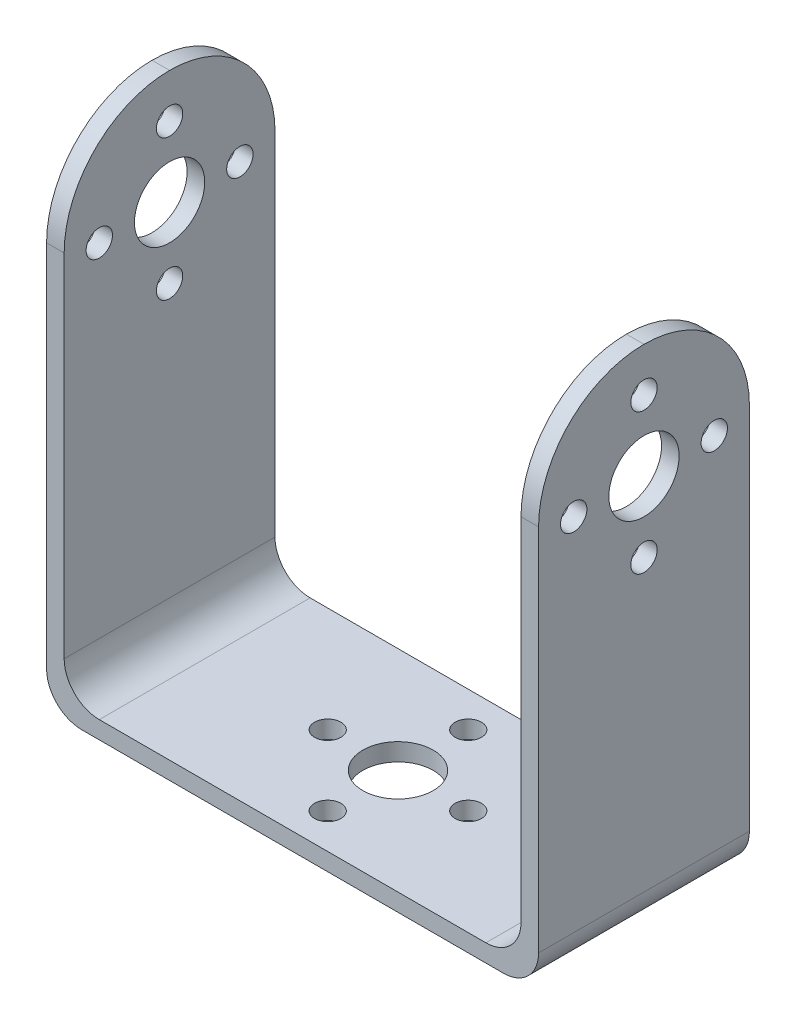
ISO-10303-21;
HEADER;
FILE_DESCRIPTION(('STEP AP214'),'2;1');
FILE_NAME('part.step','',(''),(''),'','','');
FILE_SCHEMA(('AUTOMOTIVE_DESIGN { 1 0 10303 214 1 1 1 1 }'));
ENDSEC;
DATA;
#1=APPLICATION_CONTEXT('core data for automotive mechanical design processes');
#2=APPLICATION_PROTOCOL_DEFINITION('international standard','automotive_design',2000,#1);
#3=PRODUCT_CONTEXT('',#1,'mechanical');
#4=PRODUCT('Part','Part','',(#3));
#5=PRODUCT_RELATED_PRODUCT_CATEGORY('part','',(#4));
#6=PRODUCT_DEFINITION_FORMATION('','',#4);
#7=PRODUCT_DEFINITION_CONTEXT('part definition',#1,'design');
#8=PRODUCT_DEFINITION('design','',#6,#7);
#9=PRODUCT_DEFINITION_SHAPE('','',#8);
#10=(LENGTH_UNIT() NAMED_UNIT(*) SI_UNIT(.MILLI.,.METRE.));
#11=(NAMED_UNIT(*) PLANE_ANGLE_UNIT() SI_UNIT($,.RADIAN.));
#12=(NAMED_UNIT(*) SI_UNIT($,.STERADIAN.) SOLID_ANGLE_UNIT());
#13=UNCERTAINTY_MEASURE_WITH_UNIT(LENGTH_MEASURE(1.E-05),#10,'distance_accuracy_value','');
#14=(GEOMETRIC_REPRESENTATION_CONTEXT(3) GLOBAL_UNCERTAINTY_ASSIGNED_CONTEXT((#13)) GLOBAL_UNIT_ASSIGNED_CONTEXT((#10,
#11,#12)) REPRESENTATION_CONTEXT('',''));
#15=CARTESIAN_POINT('',(0.,0.,0.));
#16=DIRECTION('',(0.,0.,1.));
#17=DIRECTION('',(1.,0.,0.));
#18=AXIS2_PLACEMENT_3D('',#15,#16,#17);
#19=CARTESIAN_POINT('',(-80.3013006654568,50.4267145135566,24.));
#20=DIRECTION('',(1.,0.,0.));
#21=DIRECTION('',(0.,0.,-1.));
#22=AXIS2_PLACEMENT_3D('',#19,#20,#21);
#23=PLANE('',#22);
#24=CARTESIAN_POINT('',(-80.3013006654568,37.4267145135566,12.));
#25=DIRECTION('',(-1.,0.,0.));
#26=DIRECTION('',(0.,0.,1.));
#27=AXIS2_PLACEMENT_3D('',#24,#25,#26);
#28=CIRCLE('',#27,3.99999999999999);
#29=CARTESIAN_POINT('',(-80.3013006654568,37.4267145135566,16.));
#30=VERTEX_POINT('',#29);
#31=EDGE_CURVE('E497',#30,#30,#28,.T.);
#32=ORIENTED_EDGE('',*,*,#31,.F.);
#33=EDGE_LOOP('',(#32));
#34=FACE_BOUND('',#33,.T.);
#35=CARTESIAN_POINT('',(-80.3013006654568,29.4267145135566,12.));
#36=DIRECTION('',(-1.,0.,0.));
#37=DIRECTION('',(0.,0.,1.));
#38=AXIS2_PLACEMENT_3D('',#35,#36,#37);
#39=CIRCLE('',#38,1.5);
#40=CARTESIAN_POINT('',(-80.3013006654568,29.4267145135566,13.5));
#41=VERTEX_POINT('',#40);
#42=EDGE_CURVE('E502',#41,#41,#39,.T.);
#43=ORIENTED_EDGE('',*,*,#42,.F.);
#44=EDGE_LOOP('',(#43));
#45=FACE_BOUND('',#44,.T.);
#46=CARTESIAN_POINT('',(-80.3013006654568,37.4267145135566,20.));
#47=DIRECTION('',(-1.,0.,0.));
#48=DIRECTION('',(0.,0.,1.));
#49=AXIS2_PLACEMENT_3D('',#46,#47,#48);
#50=CIRCLE('',#49,1.5);
#51=CARTESIAN_POINT('',(-80.3013006654568,37.4267145135566,21.5));
#52=VERTEX_POINT('',#51);
#53=EDGE_CURVE('E508',#52,#52,#50,.T.);
#54=ORIENTED_EDGE('',*,*,#53,.F.);
#55=EDGE_LOOP('',(#54));
#56=FACE_BOUND('',#55,.T.);
#57=CARTESIAN_POINT('',(-80.3013006654568,45.4267145135566,12.0000000000001));
#58=DIRECTION('',(-1.,0.,0.));
#59=DIRECTION('',(0.,0.,1.));
#60=AXIS2_PLACEMENT_3D('',#57,#58,#59);
#61=CIRCLE('',#60,1.50000000000001);
#62=CARTESIAN_POINT('',(-80.3013006654568,45.4267145135566,13.5000000000001));
#63=VERTEX_POINT('',#62);
#64=EDGE_CURVE('E514',#63,#63,#61,.T.);
#65=ORIENTED_EDGE('',*,*,#64,.F.);
#66=EDGE_LOOP('',(#65));
#67=FACE_BOUND('',#66,.T.);
#68=CARTESIAN_POINT('',(-80.3013006654568,37.4267145135567,4.));
#69=DIRECTION('',(-1.,0.,0.));
#70=DIRECTION('',(0.,0.,1.));
#71=AXIS2_PLACEMENT_3D('',#68,#69,#70);
#72=CIRCLE('',#71,1.5);
#73=CARTESIAN_POINT('',(-80.3013006654568,37.4267145135567,5.5));
#74=VERTEX_POINT('',#73);
#75=EDGE_CURVE('E301',#74,#74,#72,.T.);
#76=ORIENTED_EDGE('',*,*,#75,.F.);
#77=EDGE_LOOP('',(#76));
#78=FACE_BOUND('',#77,.T.);
#79=DIRECTION('',(0.,-1.,0.));
#80=VECTOR('',#79,1.);
#81=CARTESIAN_POINT('',(-80.3013006654568,50.4267145135566,0.));
#82=LINE('',#81,#80);
#83=CARTESIAN_POINT('',(-80.3013006654568,38.4267145135566,0.));
#84=VERTEX_POINT('',#83);
#85=CARTESIAN_POINT('',(-80.3013006654568,-3.57328548644335,0.));
#86=VERTEX_POINT('',#85);
#87=EDGE_CURVE('E150',#84,#86,#82,.T.);
#88=ORIENTED_EDGE('',*,*,#87,.T.);
#89=DIRECTION('',(0.,0.,-1.));
#90=VECTOR('',#89,1.);
#91=CARTESIAN_POINT('',(-80.3013006654568,-3.57328548644337,24.));
#92=LINE('',#91,#90);
#93=CARTESIAN_POINT('',(-80.3013006654568,-3.57328548644335,24.));
#94=VERTEX_POINT('',#93);
#95=EDGE_CURVE('E61',#86,#94,#92,.F.);
#96=ORIENTED_EDGE('',*,*,#95,.T.);
#97=DIRECTION('',(0.,-1.,0.));
#98=VECTOR('',#97,1.);
#99=CARTESIAN_POINT('',(-80.3013006654568,50.4267145135566,24.));
#100=LINE('',#99,#98);
#101=CARTESIAN_POINT('',(-80.3013006654568,38.4267145135566,24.));
#102=VERTEX_POINT('',#101);
#103=EDGE_CURVE('E271',#102,#94,#100,.T.);
#104=ORIENTED_EDGE('',*,*,#103,.F.);
#105=CARTESIAN_POINT('',(-80.3013006654568,38.4267145135566,12.));
#106=DIRECTION('',(1.,0.,0.));
#107=DIRECTION('',(0.,0.,-1.));
#108=AXIS2_PLACEMENT_3D('',#105,#106,#107);
#109=CIRCLE('',#108,12.);
#110=CARTESIAN_POINT('',(-80.3013006654568,50.4267145135566,12.));
#111=VERTEX_POINT('',#110);
#112=EDGE_CURVE('E152',#102,#111,#109,.F.);
#113=ORIENTED_EDGE('',*,*,#112,.T.);
#114=CARTESIAN_POINT('',(-80.3013006654568,38.4267145135566,12.));
#115=DIRECTION('',(1.,0.,0.));
#116=DIRECTION('',(0.,0.,-1.));
#117=AXIS2_PLACEMENT_3D('',#114,#115,#116);
#118=CIRCLE('',#117,12.);
#119=EDGE_CURVE('E148',#111,#84,#118,.F.);
#120=ORIENTED_EDGE('',*,*,#119,.T.);
#121=EDGE_LOOP('',(#88,#96,#104,#113,#120));
#122=FACE_BOUND('',#121,.T.);
#123=ADVANCED_FACE('F46',(#34,#45,#56,#67,#78,#122),#23,.F.);
#124=CARTESIAN_POINT('',(-80.3013006654568,-7.57328548644337,24.));
#125=DIRECTION('',(0.,1.,0.));
#126=DIRECTION('',(0.,0.,1.));
#127=AXIS2_PLACEMENT_3D('',#124,#125,#126);
#128=PLANE('',#127);
#129=CARTESIAN_POINT('',(-52.3013006654567,-7.57328548644337,20.));
#130=DIRECTION('',(0.,-1.,0.));
#131=DIRECTION('',(0.,0.,-1.));
#132=AXIS2_PLACEMENT_3D('',#129,#130,#131);
#133=CIRCLE('',#132,1.5);
#134=CARTESIAN_POINT('',(-52.3013006654567,-7.57328548644337,18.5));
#135=VERTEX_POINT('',#134);
#136=EDGE_CURVE('E478',#135,#135,#133,.T.);
#137=ORIENTED_EDGE('',*,*,#136,.F.);
#138=EDGE_LOOP('',(#137));
#139=FACE_BOUND('',#138,.T.);
#140=CARTESIAN_POINT('',(-52.3013006654568,-7.57328548644337,12.));
#141=DIRECTION('',(0.,-1.,0.));
#142=DIRECTION('',(0.,0.,-1.));
#143=AXIS2_PLACEMENT_3D('',#140,#141,#142);
#144=CIRCLE('',#143,4.);
#145=CARTESIAN_POINT('',(-52.3013006654568,-7.57328548644337,8.));
#146=VERTEX_POINT('',#145);
#147=EDGE_CURVE('E471',#146,#146,#144,.T.);
#148=ORIENTED_EDGE('',*,*,#147,.F.);
#149=EDGE_LOOP('',(#148));
#150=FACE_BOUND('',#149,.T.);
#151=CARTESIAN_POINT('',(-60.3013006654568,-7.57328548644337,12.));
#152=DIRECTION('',(0.,-1.,0.));
#153=DIRECTION('',(0.,0.,-1.));
#154=AXIS2_PLACEMENT_3D('',#151,#152,#153);
#155=CIRCLE('',#154,1.5);
#156=CARTESIAN_POINT('',(-60.3013006654568,-7.57328548644337,10.5));
#157=VERTEX_POINT('',#156);
#158=EDGE_CURVE('E476',#157,#157,#155,.T.);
#159=ORIENTED_EDGE('',*,*,#158,.F.);
#160=EDGE_LOOP('',(#159));
#161=FACE_BOUND('',#160,.T.);
#162=CARTESIAN_POINT('',(-52.3013006654568,-7.57328548644337,4.));
#163=DIRECTION('',(0.,-1.,0.));
#164=DIRECTION('',(0.,0.,-1.));
#165=AXIS2_PLACEMENT_3D('',#162,#163,#164);
#166=CIRCLE('',#165,1.5);
#167=CARTESIAN_POINT('',(-52.3013006654568,-7.57328548644337,2.5));
#168=VERTEX_POINT('',#167);
#169=EDGE_CURVE('E487',#168,#168,#166,.T.);
#170=ORIENTED_EDGE('',*,*,#169,.F.);
#171=EDGE_LOOP('',(#170));
#172=FACE_BOUND('',#171,.T.);
#173=CARTESIAN_POINT('',(-44.3013006654568,-7.57328548644337,11.9999999999999));
#174=DIRECTION('',(0.,-1.,0.));
#175=DIRECTION('',(0.,0.,-1.));
#176=AXIS2_PLACEMENT_3D('',#173,#174,#175);
#177=CIRCLE('',#176,1.5);
#178=CARTESIAN_POINT('',(-44.3013006654568,-7.57328548644337,10.4999999999999));
#179=VERTEX_POINT('',#178);
#180=EDGE_CURVE('E490',#179,#179,#177,.T.);
#181=ORIENTED_EDGE('',*,*,#180,.F.);
#182=EDGE_LOOP('',(#181));
#183=FACE_BOUND('',#182,.T.);
#184=DIRECTION('',(1.,0.,0.));
#185=VECTOR('',#184,1.);
#186=CARTESIAN_POINT('',(-80.3013006654568,-7.57328548644337,0.));
#187=LINE('',#186,#185);
#188=CARTESIAN_POINT('',(-76.3013006654568,-7.57328548644337,0.));
#189=VERTEX_POINT('',#188);
#190=CARTESIAN_POINT('',(-28.3013006654568,-7.57328548644337,0.));
#191=VERTEX_POINT('',#190);
#192=EDGE_CURVE('E167',#189,#191,#187,.T.);
#193=ORIENTED_EDGE('',*,*,#192,.T.);
#194=DIRECTION('',(0.,0.,-1.));
#195=VECTOR('',#194,1.);
#196=CARTESIAN_POINT('',(-28.3013006654568,-7.57328548644337,24.));
#197=LINE('',#196,#195);
#198=CARTESIAN_POINT('',(-28.3013006654568,-7.57328548644337,24.));
#199=VERTEX_POINT('',#198);
#200=EDGE_CURVE('E69',#191,#199,#197,.F.);
#201=ORIENTED_EDGE('',*,*,#200,.T.);
#202=DIRECTION('',(1.,0.,0.));
#203=VECTOR('',#202,1.);
#204=CARTESIAN_POINT('',(-80.3013006654568,-7.57328548644337,24.));
#205=LINE('',#204,#203);
#206=CARTESIAN_POINT('',(-76.3013006654568,-7.57328548644337,24.));
#207=VERTEX_POINT('',#206);
#208=EDGE_CURVE('E312',#207,#199,#205,.T.);
#209=ORIENTED_EDGE('',*,*,#208,.F.);
#210=DIRECTION('',(0.,0.,-1.));
#211=VECTOR('',#210,1.);
#212=CARTESIAN_POINT('',(-76.3013006654568,-7.57328548644337,24.));
#213=LINE('',#212,#211);
#214=EDGE_CURVE('E218',#207,#189,#213,.T.);
#215=ORIENTED_EDGE('',*,*,#214,.T.);
#216=EDGE_LOOP('',(#193,#201,#209,#215));
#217=FACE_BOUND('',#216,.T.);
#218=ADVANCED_FACE('F337',(#139,#150,#161,#172,#183,#217),#128,.F.);
#219=CARTESIAN_POINT('',(-24.3013006654568,-7.57328548644337,24.));
#220=DIRECTION('',(-1.,0.,0.));
#221=DIRECTION('',(0.,0.,1.));
#222=AXIS2_PLACEMENT_3D('',#219,#220,#221);
#223=PLANE('',#222);
#224=CARTESIAN_POINT('',(-24.3013006654568,45.4267145135566,12.));
#225=DIRECTION('',(1.,0.,0.));
#226=DIRECTION('',(0.,0.,-1.));
#227=AXIS2_PLACEMENT_3D('',#224,#225,#226);
#228=CIRCLE('',#227,1.5);
#229=CARTESIAN_POINT('',(-24.3013006654568,45.4267145135566,10.5));
#230=VERTEX_POINT('',#229);
#231=EDGE_CURVE('E290',#230,#230,#228,.T.);
#232=ORIENTED_EDGE('',*,*,#231,.F.);
#233=EDGE_LOOP('',(#232));
#234=FACE_BOUND('',#233,.T.);
#235=CARTESIAN_POINT('',(-24.3013006654568,37.4267145135566,20.));
#236=DIRECTION('',(1.,0.,0.));
#237=DIRECTION('',(0.,0.,-1.));
#238=AXIS2_PLACEMENT_3D('',#235,#236,#237);
#239=CIRCLE('',#238,1.5);
#240=CARTESIAN_POINT('',(-24.3013006654568,37.4267145135566,18.5));
#241=VERTEX_POINT('',#240);
#242=EDGE_CURVE('E286',#241,#241,#239,.T.);
#243=ORIENTED_EDGE('',*,*,#242,.F.);
#244=EDGE_LOOP('',(#243));
#245=FACE_BOUND('',#244,.T.);
#246=CARTESIAN_POINT('',(-24.3013006654568,29.4267145135566,12.));
#247=DIRECTION('',(1.,0.,0.));
#248=DIRECTION('',(0.,0.,-1.));
#249=AXIS2_PLACEMENT_3D('',#246,#247,#248);
#250=CIRCLE('',#249,1.5);
#251=CARTESIAN_POINT('',(-24.3013006654568,29.4267145135566,10.5));
#252=VERTEX_POINT('',#251);
#253=EDGE_CURVE('E282',#252,#252,#250,.T.);
#254=ORIENTED_EDGE('',*,*,#253,.F.);
#255=EDGE_LOOP('',(#254));
#256=FACE_BOUND('',#255,.T.);
#257=CARTESIAN_POINT('',(-24.3013006654568,37.4267145135566,4.));
#258=DIRECTION('',(1.,0.,0.));
#259=DIRECTION('',(0.,0.,-1.));
#260=AXIS2_PLACEMENT_3D('',#257,#258,#259);
#261=CIRCLE('',#260,1.5);
#262=CARTESIAN_POINT('',(-24.3013006654568,37.4267145135566,2.5));
#263=VERTEX_POINT('',#262);
#264=EDGE_CURVE('E278',#263,#263,#261,.T.);
#265=ORIENTED_EDGE('',*,*,#264,.F.);
#266=EDGE_LOOP('',(#265));
#267=FACE_BOUND('',#266,.T.);
#268=CARTESIAN_POINT('',(-24.3013006654568,37.4267145135566,12.));
#269=DIRECTION('',(1.,0.,0.));
#270=DIRECTION('',(0.,0.,-1.));
#271=AXIS2_PLACEMENT_3D('',#268,#269,#270);
#272=CIRCLE('',#271,3.99999999999999);
#273=CARTESIAN_POINT('',(-24.3013006654568,37.4267145135566,8.00000000000001));
#274=VERTEX_POINT('',#273);
#275=EDGE_CURVE('E274',#274,#274,#272,.T.);
#276=ORIENTED_EDGE('',*,*,#275,.F.);
#277=EDGE_LOOP('',(#276));
#278=FACE_BOUND('',#277,.T.);
#279=DIRECTION('',(0.,1.,0.));
#280=VECTOR('',#279,1.);
#281=CARTESIAN_POINT('',(-24.3013006654568,-7.57328548644337,24.));
#282=LINE('',#281,#280);
#283=CARTESIAN_POINT('',(-24.3013006654568,-3.57328548644337,24.));
#284=VERTEX_POINT('',#283);
#285=CARTESIAN_POINT('',(-24.3013006654568,38.4267145135566,24.));
#286=VERTEX_POINT('',#285);
#287=EDGE_CURVE('E262',#284,#286,#282,.T.);
#288=ORIENTED_EDGE('',*,*,#287,.F.);
#289=DIRECTION('',(0.,0.,-1.));
#290=VECTOR('',#289,1.);
#291=CARTESIAN_POINT('',(-24.3013006654568,-3.57328548644337,24.));
#292=LINE('',#291,#290);
#293=CARTESIAN_POINT('',(-24.3013006654568,-3.57328548644337,0.));
#294=VERTEX_POINT('',#293);
#295=EDGE_CURVE('E212',#284,#294,#292,.T.);
#296=ORIENTED_EDGE('',*,*,#295,.T.);
#297=DIRECTION('',(0.,1.,0.));
#298=VECTOR('',#297,1.);
#299=CARTESIAN_POINT('',(-24.3013006654568,-7.57328548644337,0.));
#300=LINE('',#299,#298);
#301=CARTESIAN_POINT('',(-24.3013006654568,38.4267145135566,0.));
#302=VERTEX_POINT('',#301);
#303=EDGE_CURVE('E245',#294,#302,#300,.T.);
#304=ORIENTED_EDGE('',*,*,#303,.T.);
#305=CARTESIAN_POINT('',(-24.3013006654568,38.4267145135566,12.));
#306=DIRECTION('',(-1.,0.,0.));
#307=DIRECTION('',(0.,0.,1.));
#308=AXIS2_PLACEMENT_3D('',#305,#306,#307);
#309=CIRCLE('',#308,12.);
#310=CARTESIAN_POINT('',(-24.3013006654568,50.4267145135566,12.));
#311=VERTEX_POINT('',#310);
#312=EDGE_CURVE('E190',#302,#311,#309,.F.);
#313=ORIENTED_EDGE('',*,*,#312,.T.);
#314=CARTESIAN_POINT('',(-24.3013006654568,38.4267145135566,12.));
#315=DIRECTION('',(-1.,0.,0.));
#316=DIRECTION('',(0.,0.,1.));
#317=AXIS2_PLACEMENT_3D('',#314,#315,#316);
#318=CIRCLE('',#317,12.);
#319=EDGE_CURVE('E192',#311,#286,#318,.F.);
#320=ORIENTED_EDGE('',*,*,#319,.T.);
#321=EDGE_LOOP('',(#288,#296,#304,#313,#320));
#322=FACE_BOUND('',#321,.T.);
#323=ADVANCED_FACE('F319',(#234,#245,#256,#267,#278,#322),#223,.F.);
#324=CARTESIAN_POINT('',(-26.3013006654568,-5.57328548644337,24.));
#325=DIRECTION('',(1.,0.,0.));
#326=DIRECTION('',(0.,0.,-1.));
#327=AXIS2_PLACEMENT_3D('',#324,#325,#326);
#328=PLANE('',#327);
#329=CARTESIAN_POINT('',(-26.3013006654568,45.4267145135566,12.));
#330=DIRECTION('',(1.,0.,0.));
#331=DIRECTION('',(0.,0.,-1.));
#332=AXIS2_PLACEMENT_3D('',#329,#330,#331);
#333=CIRCLE('',#332,1.5);
#334=CARTESIAN_POINT('',(-26.3013006654568,45.4267145135566,10.5));
#335=VERTEX_POINT('',#334);
#336=EDGE_CURVE('E287',#335,#335,#333,.T.);
#337=ORIENTED_EDGE('',*,*,#336,.T.);
#338=EDGE_LOOP('',(#337));
#339=FACE_BOUND('',#338,.T.);
#340=CARTESIAN_POINT('',(-26.3013006654568,37.4267145135566,20.));
#341=DIRECTION('',(1.,0.,0.));
#342=DIRECTION('',(0.,0.,-1.));
#343=AXIS2_PLACEMENT_3D('',#340,#341,#342);
#344=CIRCLE('',#343,1.5);
#345=CARTESIAN_POINT('',(-26.3013006654568,37.4267145135566,18.5));
#346=VERTEX_POINT('',#345);
#347=EDGE_CURVE('E283',#346,#346,#344,.T.);
#348=ORIENTED_EDGE('',*,*,#347,.T.);
#349=EDGE_LOOP('',(#348));
#350=FACE_BOUND('',#349,.T.);
#351=CARTESIAN_POINT('',(-26.3013006654568,29.4267145135566,12.));
#352=DIRECTION('',(1.,0.,0.));
#353=DIRECTION('',(0.,0.,-1.));
#354=AXIS2_PLACEMENT_3D('',#351,#352,#353);
#355=CIRCLE('',#354,1.5);
#356=CARTESIAN_POINT('',(-26.3013006654568,29.4267145135566,10.5));
#357=VERTEX_POINT('',#356);
#358=EDGE_CURVE('E279',#357,#357,#355,.T.);
#359=ORIENTED_EDGE('',*,*,#358,.T.);
#360=EDGE_LOOP('',(#359));
#361=FACE_BOUND('',#360,.T.);
#362=CARTESIAN_POINT('',(-26.3013006654568,37.4267145135566,4.));
#363=DIRECTION('',(1.,0.,0.));
#364=DIRECTION('',(0.,0.,-1.));
#365=AXIS2_PLACEMENT_3D('',#362,#363,#364);
#366=CIRCLE('',#365,1.5);
#367=CARTESIAN_POINT('',(-26.3013006654568,37.4267145135566,2.5));
#368=VERTEX_POINT('',#367);
#369=EDGE_CURVE('E275',#368,#368,#366,.T.);
#370=ORIENTED_EDGE('',*,*,#369,.T.);
#371=EDGE_LOOP('',(#370));
#372=FACE_BOUND('',#371,.T.);
#373=CARTESIAN_POINT('',(-26.3013006654568,37.4267145135566,12.));
#374=DIRECTION('',(1.,0.,0.));
#375=DIRECTION('',(0.,0.,-1.));
#376=AXIS2_PLACEMENT_3D('',#373,#374,#375);
#377=CIRCLE('',#376,3.99999999999999);
#378=CARTESIAN_POINT('',(-26.3013006654568,37.4267145135566,8.00000000000001));
#379=VERTEX_POINT('',#378);
#380=EDGE_CURVE('E168',#379,#379,#377,.T.);
#381=ORIENTED_EDGE('',*,*,#380,.T.);
#382=EDGE_LOOP('',(#381));
#383=FACE_BOUND('',#382,.T.);
#384=DIRECTION('',(0.,-1.,0.));
#385=VECTOR('',#384,1.);
#386=CARTESIAN_POINT('',(-26.3013006654568,-5.57328548644337,0.));
#387=LINE('',#386,#385);
#388=CARTESIAN_POINT('',(-26.3013006654568,38.4267145135566,0.));
#389=VERTEX_POINT('',#388);
#390=CARTESIAN_POINT('',(-26.3013006654568,-1.57328548644337,0.));
#391=VERTEX_POINT('',#390);
#392=EDGE_CURVE('E233',#389,#391,#387,.T.);
#393=ORIENTED_EDGE('',*,*,#392,.T.);
#394=DIRECTION('',(0.,0.,-1.));
#395=VECTOR('',#394,1.);
#396=CARTESIAN_POINT('',(-26.3013006654568,-1.57328548644337,24.));
#397=LINE('',#396,#395);
#398=CARTESIAN_POINT('',(-26.3013006654568,-1.57328548644337,24.));
#399=VERTEX_POINT('',#398);
#400=EDGE_CURVE('E210',#391,#399,#397,.F.);
#401=ORIENTED_EDGE('',*,*,#400,.T.);
#402=DIRECTION('',(0.,-1.,0.));
#403=VECTOR('',#402,1.);
#404=CARTESIAN_POINT('',(-26.3013006654568,-5.57328548644337,24.));
#405=LINE('',#404,#403);
#406=CARTESIAN_POINT('',(-26.3013006654568,38.4267145135566,24.));
#407=VERTEX_POINT('',#406);
#408=EDGE_CURVE('E255',#407,#399,#405,.T.);
#409=ORIENTED_EDGE('',*,*,#408,.F.);
#410=CARTESIAN_POINT('',(-26.3013006654568,38.4267145135566,12.));
#411=DIRECTION('',(1.,0.,0.));
#412=DIRECTION('',(0.,0.,-1.));
#413=AXIS2_PLACEMENT_3D('',#410,#411,#412);
#414=CIRCLE('',#413,12.);
#415=CARTESIAN_POINT('',(-26.3013006654568,50.4267145135566,12.));
#416=VERTEX_POINT('',#415);
#417=EDGE_CURVE('E188',#407,#416,#414,.F.);
#418=ORIENTED_EDGE('',*,*,#417,.T.);
#419=CARTESIAN_POINT('',(-26.3013006654568,38.4267145135566,12.));
#420=DIRECTION('',(1.,0.,0.));
#421=DIRECTION('',(0.,0.,-1.));
#422=AXIS2_PLACEMENT_3D('',#419,#420,#421);
#423=CIRCLE('',#422,12.);
#424=EDGE_CURVE('E186',#416,#389,#423,.F.);
#425=ORIENTED_EDGE('',*,*,#424,.T.);
#426=EDGE_LOOP('',(#393,#401,#409,#418,#425));
#427=FACE_BOUND('',#426,.T.);
#428=ADVANCED_FACE('F241',(#339,#350,#361,#372,#383,#427),#328,.F.);
#429=CARTESIAN_POINT('',(-78.3013006654568,-5.57328548644337,24.));
#430=DIRECTION('',(0.,-1.,0.));
#431=DIRECTION('',(0.,0.,-1.));
#432=AXIS2_PLACEMENT_3D('',#429,#430,#431);
#433=PLANE('',#432);
#434=CARTESIAN_POINT('',(-52.3013006654567,-5.57328548644337,20.));
#435=DIRECTION('',(0.,-1.,0.));
#436=DIRECTION('',(0.,0.,-1.));
#437=AXIS2_PLACEMENT_3D('',#434,#435,#436);
#438=CIRCLE('',#437,1.5);
#439=CARTESIAN_POINT('',(-52.3013006654567,-5.57328548644337,18.5));
#440=VERTEX_POINT('',#439);
#441=EDGE_CURVE('E481',#440,#440,#438,.T.);
#442=ORIENTED_EDGE('',*,*,#441,.T.);
#443=EDGE_LOOP('',(#442));
#444=FACE_BOUND('',#443,.T.);
#445=CARTESIAN_POINT('',(-52.3013006654568,-5.57328548644337,12.));
#446=DIRECTION('',(0.,-1.,0.));
#447=DIRECTION('',(0.,0.,-1.));
#448=AXIS2_PLACEMENT_3D('',#445,#446,#447);
#449=CIRCLE('',#448,4.);
#450=CARTESIAN_POINT('',(-52.3013006654568,-5.57328548644337,8.));
#451=VERTEX_POINT('',#450);
#452=EDGE_CURVE('E468',#451,#451,#449,.T.);
#453=ORIENTED_EDGE('',*,*,#452,.T.);
#454=EDGE_LOOP('',(#453));
#455=FACE_BOUND('',#454,.T.);
#456=CARTESIAN_POINT('',(-60.3013006654568,-5.57328548644337,12.));
#457=DIRECTION('',(0.,-1.,0.));
#458=DIRECTION('',(0.,0.,-1.));
#459=AXIS2_PLACEMENT_3D('',#456,#457,#458);
#460=CIRCLE('',#459,1.5);
#461=CARTESIAN_POINT('',(-60.3013006654568,-5.57328548644337,10.5));
#462=VERTEX_POINT('',#461);
#463=EDGE_CURVE('E473',#462,#462,#460,.T.);
#464=ORIENTED_EDGE('',*,*,#463,.T.);
#465=EDGE_LOOP('',(#464));
#466=FACE_BOUND('',#465,.T.);
#467=CARTESIAN_POINT('',(-52.3013006654568,-5.57328548644337,4.));
#468=DIRECTION('',(0.,-1.,0.));
#469=DIRECTION('',(0.,0.,-1.));
#470=AXIS2_PLACEMENT_3D('',#467,#468,#469);
#471=CIRCLE('',#470,1.5);
#472=CARTESIAN_POINT('',(-52.3013006654568,-5.57328548644337,2.5));
#473=VERTEX_POINT('',#472);
#474=EDGE_CURVE('E485',#473,#473,#471,.T.);
#475=ORIENTED_EDGE('',*,*,#474,.T.);
#476=EDGE_LOOP('',(#475));
#477=FACE_BOUND('',#476,.T.);
#478=CARTESIAN_POINT('',(-44.3013006654568,-5.57328548644337,11.9999999999999));
#479=DIRECTION('',(0.,-1.,0.));
#480=DIRECTION('',(0.,0.,-1.));
#481=AXIS2_PLACEMENT_3D('',#478,#479,#480);
#482=CIRCLE('',#481,1.5);
#483=CARTESIAN_POINT('',(-44.3013006654568,-5.57328548644337,10.4999999999999));
#484=VERTEX_POINT('',#483);
#485=EDGE_CURVE('E202',#484,#484,#482,.T.);
#486=ORIENTED_EDGE('',*,*,#485,.T.);
#487=EDGE_LOOP('',(#486));
#488=FACE_BOUND('',#487,.T.);
#489=DIRECTION('',(-1.,0.,0.));
#490=VECTOR('',#489,1.);
#491=CARTESIAN_POINT('',(-78.3013006654568,-5.57328548644337,0.));
#492=LINE('',#491,#490);
#493=CARTESIAN_POINT('',(-30.3013006654568,-5.57328548644337,0.));
#494=VERTEX_POINT('',#493);
#495=CARTESIAN_POINT('',(-74.3013006654568,-5.57328548644337,0.));
#496=VERTEX_POINT('',#495);
#497=EDGE_CURVE('E236',#494,#496,#492,.T.);
#498=ORIENTED_EDGE('',*,*,#497,.T.);
#499=DIRECTION('',(0.,0.,-1.));
#500=VECTOR('',#499,1.);
#501=CARTESIAN_POINT('',(-74.3013006654568,-5.57328548644337,24.));
#502=LINE('',#501,#500);
#503=CARTESIAN_POINT('',(-74.3013006654568,-5.57328548644337,24.));
#504=VERTEX_POINT('',#503);
#505=EDGE_CURVE('E208',#496,#504,#502,.F.);
#506=ORIENTED_EDGE('',*,*,#505,.T.);
#507=DIRECTION('',(-1.,0.,0.));
#508=VECTOR('',#507,1.);
#509=CARTESIAN_POINT('',(-78.3013006654568,-5.57328548644337,24.));
#510=LINE('',#509,#508);
#511=CARTESIAN_POINT('',(-30.3013006654568,-5.57328548644337,24.));
#512=VERTEX_POINT('',#511);
#513=EDGE_CURVE('E253',#512,#504,#510,.T.);
#514=ORIENTED_EDGE('',*,*,#513,.F.);
#515=DIRECTION('',(0.,0.,-1.));
#516=VECTOR('',#515,1.);
#517=CARTESIAN_POINT('',(-30.3013006654568,-5.57328548644337,0.));
#518=LINE('',#517,#516);
#519=EDGE_CURVE('E205',#512,#494,#518,.T.);
#520=ORIENTED_EDGE('',*,*,#519,.T.);
#521=EDGE_LOOP('',(#498,#506,#514,#520));
#522=FACE_BOUND('',#521,.T.);
#523=ADVANCED_FACE('F257',(#444,#455,#466,#477,#488,#522),#433,.F.);
#524=CARTESIAN_POINT('',(-78.3013006654568,50.4267145135566,24.));
#525=DIRECTION('',(-1.,0.,0.));
#526=DIRECTION('',(0.,-1.,0.));
#527=AXIS2_PLACEMENT_3D('',#524,#525,#526);
#528=PLANE('',#527);
#529=CARTESIAN_POINT('',(-78.3013006654568,37.4267145135566,12.));
#530=DIRECTION('',(-1.,0.,0.));
#531=DIRECTION('',(0.,0.,1.));
#532=AXIS2_PLACEMENT_3D('',#529,#530,#531);
#533=CIRCLE('',#532,3.99999999999999);
#534=CARTESIAN_POINT('',(-78.3013006654568,37.4267145135566,16.));
#535=VERTEX_POINT('',#534);
#536=EDGE_CURVE('E198',#535,#535,#533,.T.);
#537=ORIENTED_EDGE('',*,*,#536,.T.);
#538=EDGE_LOOP('',(#537));
#539=FACE_BOUND('',#538,.T.);
#540=CARTESIAN_POINT('',(-78.3013006654568,29.4267145135566,12.));
#541=DIRECTION('',(-1.,0.,0.));
#542=DIRECTION('',(0.,0.,1.));
#543=AXIS2_PLACEMENT_3D('',#540,#541,#542);
#544=CIRCLE('',#543,1.5);
#545=CARTESIAN_POINT('',(-78.3013006654568,29.4267145135566,13.5));
#546=VERTEX_POINT('',#545);
#547=EDGE_CURVE('E500',#546,#546,#544,.T.);
#548=ORIENTED_EDGE('',*,*,#547,.T.);
#549=EDGE_LOOP('',(#548));
#550=FACE_BOUND('',#549,.T.);
#551=CARTESIAN_POINT('',(-78.3013006654568,37.4267145135566,20.));
#552=DIRECTION('',(-1.,0.,0.));
#553=DIRECTION('',(0.,0.,1.));
#554=AXIS2_PLACEMENT_3D('',#551,#552,#553);
#555=CIRCLE('',#554,1.5);
#556=CARTESIAN_POINT('',(-78.3013006654568,37.4267145135566,21.5));
#557=VERTEX_POINT('',#556);
#558=EDGE_CURVE('E505',#557,#557,#555,.T.);
#559=ORIENTED_EDGE('',*,*,#558,.T.);
#560=EDGE_LOOP('',(#559));
#561=FACE_BOUND('',#560,.T.);
#562=CARTESIAN_POINT('',(-78.3013006654568,45.4267145135566,12.0000000000001));
#563=DIRECTION('',(-1.,0.,0.));
#564=DIRECTION('',(0.,0.,1.));
#565=AXIS2_PLACEMENT_3D('',#562,#563,#564);
#566=CIRCLE('',#565,1.50000000000001);
#567=CARTESIAN_POINT('',(-78.3013006654568,45.4267145135566,13.5000000000001));
#568=VERTEX_POINT('',#567);
#569=EDGE_CURVE('E511',#568,#568,#566,.T.);
#570=ORIENTED_EDGE('',*,*,#569,.T.);
#571=EDGE_LOOP('',(#570));
#572=FACE_BOUND('',#571,.T.);
#573=CARTESIAN_POINT('',(-78.3013006654568,37.4267145135567,4.));
#574=DIRECTION('',(-1.,0.,0.));
#575=DIRECTION('',(0.,0.,1.));
#576=AXIS2_PLACEMENT_3D('',#573,#574,#575);
#577=CIRCLE('',#576,1.5);
#578=CARTESIAN_POINT('',(-78.3013006654568,37.4267145135567,5.5));
#579=VERTEX_POINT('',#578);
#580=EDGE_CURVE('E296',#579,#579,#577,.T.);
#581=ORIENTED_EDGE('',*,*,#580,.T.);
#582=EDGE_LOOP('',(#581));
#583=FACE_BOUND('',#582,.T.);
#584=DIRECTION('',(0.,1.,0.));
#585=VECTOR('',#584,1.);
#586=CARTESIAN_POINT('',(-78.3013006654568,50.4267145135566,24.));
#587=LINE('',#586,#585);
#588=CARTESIAN_POINT('',(-78.3013006654568,-1.57328548644337,24.));
#589=VERTEX_POINT('',#588);
#590=CARTESIAN_POINT('',(-78.3013006654568,38.4267145135566,24.));
#591=VERTEX_POINT('',#590);
#592=EDGE_CURVE('E259',#589,#591,#587,.T.);
#593=ORIENTED_EDGE('',*,*,#592,.F.);
#594=DIRECTION('',(0.,0.,-1.));
#595=VECTOR('',#594,1.);
#596=CARTESIAN_POINT('',(-78.3013006654568,-1.57328548644337,0.));
#597=LINE('',#596,#595);
#598=CARTESIAN_POINT('',(-78.3013006654568,-1.57328548644337,0.));
#599=VERTEX_POINT('',#598);
#600=EDGE_CURVE('E195',#589,#599,#597,.T.);
#601=ORIENTED_EDGE('',*,*,#600,.T.);
#602=DIRECTION('',(0.,1.,0.));
#603=VECTOR('',#602,1.);
#604=CARTESIAN_POINT('',(-78.3013006654568,50.4267145135566,0.));
#605=LINE('',#604,#603);
#606=CARTESIAN_POINT('',(-78.3013006654568,38.4267145135566,0.));
#607=VERTEX_POINT('',#606);
#608=EDGE_CURVE('E269',#599,#607,#605,.T.);
#609=ORIENTED_EDGE('',*,*,#608,.T.);
#610=CARTESIAN_POINT('',(-78.3013006654568,38.4267145135566,12.));
#611=DIRECTION('',(-1.,0.,0.));
#612=DIRECTION('',(0.,-1.,0.));
#613=AXIS2_PLACEMENT_3D('',#610,#611,#612);
#614=CIRCLE('',#613,12.);
#615=CARTESIAN_POINT('',(-78.3013006654568,50.4267145135566,12.));
#616=VERTEX_POINT('',#615);
#617=EDGE_CURVE('E172',#607,#616,#614,.F.);
#618=ORIENTED_EDGE('',*,*,#617,.T.);
#619=CARTESIAN_POINT('',(-78.3013006654568,38.4267145135566,12.));
#620=DIRECTION('',(-1.,0.,0.));
#621=DIRECTION('',(0.,-1.,0.));
#622=AXIS2_PLACEMENT_3D('',#619,#620,#621);
#623=CIRCLE('',#622,12.);
#624=EDGE_CURVE('E173',#616,#591,#623,.F.);
#625=ORIENTED_EDGE('',*,*,#624,.T.);
#626=EDGE_LOOP('',(#593,#601,#609,#618,#625));
#627=FACE_BOUND('',#626,.T.);
#628=ADVANCED_FACE('F373',(#539,#550,#561,#572,#583,#627),#528,.F.);
#629=CARTESIAN_POINT('',(0.,0.,24.));
#630=DIRECTION('',(0.,0.,-1.));
#631=DIRECTION('',(-1.,0.,0.));
#632=AXIS2_PLACEMENT_3D('',#629,#630,#631);
#633=PLANE('',#632);
#634=ORIENTED_EDGE('',*,*,#208,.T.);
#635=CARTESIAN_POINT('',(-28.3013006654568,-3.57328548644337,24.));
#636=DIRECTION('',(0.,0.,-1.));
#637=DIRECTION('',(-1.,0.,0.));
#638=AXIS2_PLACEMENT_3D('',#635,#636,#637);
#639=CIRCLE('',#638,4.);
#640=EDGE_CURVE('E224',#199,#284,#639,.F.);
#641=ORIENTED_EDGE('',*,*,#640,.T.);
#642=ORIENTED_EDGE('',*,*,#287,.T.);
#643=DIRECTION('',(-1.,0.,0.));
#644=VECTOR('',#643,1.);
#645=CARTESIAN_POINT('',(0.,38.4267145135566,24.));
#646=LINE('',#645,#644);
#647=EDGE_CURVE('E181',#286,#407,#646,.T.);
#648=ORIENTED_EDGE('',*,*,#647,.T.);
#649=ORIENTED_EDGE('',*,*,#408,.T.);
#650=CARTESIAN_POINT('',(-30.3013006654568,-1.57328548644337,24.));
#651=DIRECTION('',(0.,0.,-1.));
#652=DIRECTION('',(-1.,0.,0.));
#653=AXIS2_PLACEMENT_3D('',#650,#651,#652);
#654=CIRCLE('',#653,4.);
#655=EDGE_CURVE('E12',#399,#512,#654,.T.);
#656=ORIENTED_EDGE('',*,*,#655,.T.);
#657=ORIENTED_EDGE('',*,*,#513,.T.);
#658=CARTESIAN_POINT('',(-74.3013006654568,-1.57328548644337,24.));
#659=DIRECTION('',(0.,0.,-1.));
#660=DIRECTION('',(-1.,0.,0.));
#661=AXIS2_PLACEMENT_3D('',#658,#659,#660);
#662=CIRCLE('',#661,4.);
#663=EDGE_CURVE('E229',#504,#589,#662,.T.);
#664=ORIENTED_EDGE('',*,*,#663,.T.);
#665=ORIENTED_EDGE('',*,*,#592,.T.);
#666=DIRECTION('',(-1.,0.,0.));
#667=VECTOR('',#666,1.);
#668=CARTESIAN_POINT('',(0.,38.4267145135566,24.));
#669=LINE('',#668,#667);
#670=EDGE_CURVE('E184',#591,#102,#669,.T.);
#671=ORIENTED_EDGE('',*,*,#670,.T.);
#672=ORIENTED_EDGE('',*,*,#103,.T.);
#673=CARTESIAN_POINT('',(-76.3013006654568,-3.57328548644337,24.));
#674=DIRECTION('',(0.,0.,-1.));
#675=DIRECTION('',(-1.,0.,0.));
#676=AXIS2_PLACEMENT_3D('',#673,#674,#675);
#677=CIRCLE('',#676,4.);
#678=EDGE_CURVE('E222',#94,#207,#677,.F.);
#679=ORIENTED_EDGE('',*,*,#678,.T.);
#680=EDGE_LOOP('',(#634,#641,#642,#648,#649,#656,#657,#664,#665,#671,#672,#679));
#681=FACE_BOUND('',#680,.T.);
#682=ADVANCED_FACE('F252',(#681),#633,.F.);
#683=CARTESIAN_POINT('',(0.,0.,0.));
#684=DIRECTION('',(0.,0.,-1.));
#685=DIRECTION('',(-1.,0.,0.));
#686=AXIS2_PLACEMENT_3D('',#683,#684,#685);
#687=PLANE('',#686);
#688=ORIENTED_EDGE('',*,*,#303,.F.);
#689=CARTESIAN_POINT('',(-28.3013006654568,-3.57328548644337,0.));
#690=DIRECTION('',(0.,0.,-1.));
#691=DIRECTION('',(-1.,0.,0.));
#692=AXIS2_PLACEMENT_3D('',#689,#690,#691);
#693=CIRCLE('',#692,4.);
#694=EDGE_CURVE('E216',#294,#191,#693,.T.);
#695=ORIENTED_EDGE('',*,*,#694,.T.);
#696=ORIENTED_EDGE('',*,*,#192,.F.);
#697=CARTESIAN_POINT('',(-76.3013006654568,-3.57328548644337,0.));
#698=DIRECTION('',(0.,0.,-1.));
#699=DIRECTION('',(-1.,0.,0.));
#700=AXIS2_PLACEMENT_3D('',#697,#698,#699);
#701=CIRCLE('',#700,4.);
#702=EDGE_CURVE('E166',#189,#86,#701,.T.);
#703=ORIENTED_EDGE('',*,*,#702,.T.);
#704=ORIENTED_EDGE('',*,*,#87,.F.);
#705=DIRECTION('',(-1.,0.,0.));
#706=VECTOR('',#705,1.);
#707=CARTESIAN_POINT('',(-78.3013006654568,38.4267145135566,0.));
#708=LINE('',#707,#706);
#709=EDGE_CURVE('E164',#84,#607,#708,.F.);
#710=ORIENTED_EDGE('',*,*,#709,.T.);
#711=ORIENTED_EDGE('',*,*,#608,.F.);
#712=CARTESIAN_POINT('',(-74.3013006654568,-1.57328548644337,0.));
#713=DIRECTION('',(0.,0.,-1.));
#714=DIRECTION('',(-1.,0.,0.));
#715=AXIS2_PLACEMENT_3D('',#712,#713,#714);
#716=CIRCLE('',#715,4.);
#717=EDGE_CURVE('E227',#599,#496,#716,.F.);
#718=ORIENTED_EDGE('',*,*,#717,.T.);
#719=ORIENTED_EDGE('',*,*,#497,.F.);
#720=CARTESIAN_POINT('',(-30.3013006654568,-1.57328548644337,0.));
#721=DIRECTION('',(0.,0.,-1.));
#722=DIRECTION('',(-1.,0.,0.));
#723=AXIS2_PLACEMENT_3D('',#720,#721,#722);
#724=CIRCLE('',#723,4.);
#725=EDGE_CURVE('E54',#494,#391,#724,.F.);
#726=ORIENTED_EDGE('',*,*,#725,.T.);
#727=ORIENTED_EDGE('',*,*,#392,.F.);
#728=DIRECTION('',(-1.,0.,0.));
#729=VECTOR('',#728,1.);
#730=CARTESIAN_POINT('',(-24.3013006654568,38.4267145135566,0.));
#731=LINE('',#730,#729);
#732=EDGE_CURVE('E157',#389,#302,#731,.F.);
#733=ORIENTED_EDGE('',*,*,#732,.T.);
#734=EDGE_LOOP('',(#688,#695,#696,#703,#704,#710,#711,#718,#719,#726,#727,#733));
#735=FACE_BOUND('',#734,.T.);
#736=ADVANCED_FACE('F162',(#735),#687,.T.);
#737=CARTESIAN_POINT('',(-43.3013006654568,37.4267145135566,12.));
#738=DIRECTION('',(1.,0.,0.));
#739=DIRECTION('',(0.,0.,-1.));
#740=AXIS2_PLACEMENT_3D('',#737,#738,#739);
#741=CYLINDRICAL_SURFACE('',#740,3.99999999999999);
#742=ORIENTED_EDGE('',*,*,#275,.T.);
#743=EDGE_LOOP('',(#742));
#744=FACE_BOUND('',#743,.T.);
#745=ORIENTED_EDGE('',*,*,#380,.F.);
#746=EDGE_LOOP('',(#745));
#747=FACE_BOUND('',#746,.T.);
#748=ADVANCED_FACE('F406',(#744,#747),#741,.F.);
#749=CARTESIAN_POINT('',(-43.3013006654568,37.4267145135566,4.));
#750=DIRECTION('',(1.,0.,0.));
#751=DIRECTION('',(0.,0.,-1.));
#752=AXIS2_PLACEMENT_3D('',#749,#750,#751);
#753=CYLINDRICAL_SURFACE('',#752,1.5);
#754=ORIENTED_EDGE('',*,*,#264,.T.);
#755=EDGE_LOOP('',(#754));
#756=FACE_BOUND('',#755,.T.);
#757=ORIENTED_EDGE('',*,*,#369,.F.);
#758=EDGE_LOOP('',(#757));
#759=FACE_BOUND('',#758,.T.);
#760=ADVANCED_FACE('F409',(#756,#759),#753,.F.);
#761=CARTESIAN_POINT('',(-43.3013006654568,29.4267145135566,12.));
#762=DIRECTION('',(1.,0.,0.));
#763=DIRECTION('',(0.,0.,-1.));
#764=AXIS2_PLACEMENT_3D('',#761,#762,#763);
#765=CYLINDRICAL_SURFACE('',#764,1.5);
#766=ORIENTED_EDGE('',*,*,#253,.T.);
#767=EDGE_LOOP('',(#766));
#768=FACE_BOUND('',#767,.T.);
#769=ORIENTED_EDGE('',*,*,#358,.F.);
#770=EDGE_LOOP('',(#769));
#771=FACE_BOUND('',#770,.T.);
#772=ADVANCED_FACE('F417',(#768,#771),#765,.F.);
#773=CARTESIAN_POINT('',(-43.3013006654568,37.4267145135566,20.));
#774=DIRECTION('',(1.,0.,0.));
#775=DIRECTION('',(0.,0.,-1.));
#776=AXIS2_PLACEMENT_3D('',#773,#774,#775);
#777=CYLINDRICAL_SURFACE('',#776,1.5);
#778=ORIENTED_EDGE('',*,*,#242,.T.);
#779=EDGE_LOOP('',(#778));
#780=FACE_BOUND('',#779,.T.);
#781=ORIENTED_EDGE('',*,*,#347,.F.);
#782=EDGE_LOOP('',(#781));
#783=FACE_BOUND('',#782,.T.);
#784=ADVANCED_FACE('F423',(#780,#783),#777,.F.);
#785=CARTESIAN_POINT('',(-43.3013006654568,45.4267145135566,12.));
#786=DIRECTION('',(1.,0.,0.));
#787=DIRECTION('',(0.,0.,-1.));
#788=AXIS2_PLACEMENT_3D('',#785,#786,#787);
#789=CYLINDRICAL_SURFACE('',#788,1.5);
#790=ORIENTED_EDGE('',*,*,#231,.T.);
#791=EDGE_LOOP('',(#790));
#792=FACE_BOUND('',#791,.T.);
#793=ORIENTED_EDGE('',*,*,#336,.F.);
#794=EDGE_LOOP('',(#793));
#795=FACE_BOUND('',#794,.T.);
#796=ADVANCED_FACE('F427',(#792,#795),#789,.F.);
#797=CARTESIAN_POINT('',(-78.3013006654568,37.4267145135567,4.));
#798=DIRECTION('',(-1.,0.,0.));
#799=DIRECTION('',(0.,0.,1.));
#800=AXIS2_PLACEMENT_3D('',#797,#798,#799);
#801=CYLINDRICAL_SURFACE('',#800,1.5);
#802=ORIENTED_EDGE('',*,*,#580,.F.);
#803=EDGE_LOOP('',(#802));
#804=FACE_BOUND('',#803,.T.);
#805=ORIENTED_EDGE('',*,*,#75,.T.);
#806=EDGE_LOOP('',(#805));
#807=FACE_BOUND('',#806,.T.);
#808=ADVANCED_FACE('F431',(#804,#807),#801,.F.);
#809=CARTESIAN_POINT('',(-78.3013006654568,45.4267145135566,12.0000000000001));
#810=DIRECTION('',(-1.,0.,0.));
#811=DIRECTION('',(0.,0.,1.));
#812=AXIS2_PLACEMENT_3D('',#809,#810,#811);
#813=CYLINDRICAL_SURFACE('',#812,1.50000000000001);
#814=ORIENTED_EDGE('',*,*,#569,.F.);
#815=EDGE_LOOP('',(#814));
#816=FACE_BOUND('',#815,.T.);
#817=ORIENTED_EDGE('',*,*,#64,.T.);
#818=EDGE_LOOP('',(#817));
#819=FACE_BOUND('',#818,.T.);
#820=ADVANCED_FACE('F434',(#816,#819),#813,.F.);
#821=CARTESIAN_POINT('',(-78.3013006654568,37.4267145135566,20.));
#822=DIRECTION('',(-1.,0.,0.));
#823=DIRECTION('',(0.,0.,1.));
#824=AXIS2_PLACEMENT_3D('',#821,#822,#823);
#825=CYLINDRICAL_SURFACE('',#824,1.5);
#826=ORIENTED_EDGE('',*,*,#558,.F.);
#827=EDGE_LOOP('',(#826));
#828=FACE_BOUND('',#827,.T.);
#829=ORIENTED_EDGE('',*,*,#53,.T.);
#830=EDGE_LOOP('',(#829));
#831=FACE_BOUND('',#830,.T.);
#832=ADVANCED_FACE('F438',(#828,#831),#825,.F.);
#833=CARTESIAN_POINT('',(-78.3013006654568,29.4267145135566,12.));
#834=DIRECTION('',(-1.,0.,0.));
#835=DIRECTION('',(0.,0.,1.));
#836=AXIS2_PLACEMENT_3D('',#833,#834,#835);
#837=CYLINDRICAL_SURFACE('',#836,1.5);
#838=ORIENTED_EDGE('',*,*,#547,.F.);
#839=EDGE_LOOP('',(#838));
#840=FACE_BOUND('',#839,.T.);
#841=ORIENTED_EDGE('',*,*,#42,.T.);
#842=EDGE_LOOP('',(#841));
#843=FACE_BOUND('',#842,.T.);
#844=ADVANCED_FACE('F442',(#840,#843),#837,.F.);
#845=CARTESIAN_POINT('',(-78.3013006654568,37.4267145135566,12.));
#846=DIRECTION('',(-1.,0.,0.));
#847=DIRECTION('',(0.,0.,1.));
#848=AXIS2_PLACEMENT_3D('',#845,#846,#847);
#849=CYLINDRICAL_SURFACE('',#848,3.99999999999999);
#850=ORIENTED_EDGE('',*,*,#536,.F.);
#851=EDGE_LOOP('',(#850));
#852=FACE_BOUND('',#851,.T.);
#853=ORIENTED_EDGE('',*,*,#31,.T.);
#854=EDGE_LOOP('',(#853));
#855=FACE_BOUND('',#854,.T.);
#856=ADVANCED_FACE('F354',(#852,#855),#849,.F.);
#857=CARTESIAN_POINT('',(0.,38.4267145135566,12.));
#858=DIRECTION('',(-1.,0.,0.));
#859=DIRECTION('',(0.,0.,1.));
#860=AXIS2_PLACEMENT_3D('',#857,#858,#859);
#861=CYLINDRICAL_SURFACE('',#860,12.);
#862=ORIENTED_EDGE('',*,*,#670,.F.);
#863=ORIENTED_EDGE('',*,*,#624,.F.);
#864=DIRECTION('',(-1.,0.,0.));
#865=VECTOR('',#864,1.);
#866=CARTESIAN_POINT('',(-80.3013006654568,50.4267145135566,12.));
#867=LINE('',#866,#865);
#868=EDGE_CURVE('E196',#111,#616,#867,.F.);
#869=ORIENTED_EDGE('',*,*,#868,.F.);
#870=ORIENTED_EDGE('',*,*,#112,.F.);
#871=EDGE_LOOP('',(#862,#863,#869,#870));
#872=FACE_BOUND('',#871,.T.);
#873=ADVANCED_FACE('F351',(#872),#861,.T.);
#874=CARTESIAN_POINT('',(-80.3013006654568,38.4267145135566,12.));
#875=DIRECTION('',(1.,0.,0.));
#876=DIRECTION('',(0.,0.,-1.));
#877=AXIS2_PLACEMENT_3D('',#874,#875,#876);
#878=CYLINDRICAL_SURFACE('',#877,12.);
#879=ORIENTED_EDGE('',*,*,#617,.F.);
#880=ORIENTED_EDGE('',*,*,#709,.F.);
#881=ORIENTED_EDGE('',*,*,#119,.F.);
#882=ORIENTED_EDGE('',*,*,#868,.T.);
#883=EDGE_LOOP('',(#879,#880,#881,#882));
#884=FACE_BOUND('',#883,.T.);
#885=ADVANCED_FACE('F171',(#884),#878,.T.);
#886=CARTESIAN_POINT('',(-26.3013006654568,38.4267145135566,12.));
#887=DIRECTION('',(1.,0.,0.));
#888=DIRECTION('',(0.,0.,-1.));
#889=AXIS2_PLACEMENT_3D('',#886,#887,#888);
#890=CYLINDRICAL_SURFACE('',#889,12.);
#891=DIRECTION('',(-1.,0.,0.));
#892=VECTOR('',#891,1.);
#893=CARTESIAN_POINT('',(-26.3013006654568,50.4267145135566,12.));
#894=LINE('',#893,#892);
#895=EDGE_CURVE('E199',#311,#416,#894,.T.);
#896=ORIENTED_EDGE('',*,*,#895,.F.);
#897=ORIENTED_EDGE('',*,*,#312,.F.);
#898=ORIENTED_EDGE('',*,*,#732,.F.);
#899=ORIENTED_EDGE('',*,*,#424,.F.);
#900=EDGE_LOOP('',(#896,#897,#898,#899));
#901=FACE_BOUND('',#900,.T.);
#902=ADVANCED_FACE('F325',(#901),#890,.T.);
#903=CARTESIAN_POINT('',(0.,38.4267145135566,12.));
#904=DIRECTION('',(-1.,0.,0.));
#905=DIRECTION('',(0.,0.,1.));
#906=AXIS2_PLACEMENT_3D('',#903,#904,#905);
#907=CYLINDRICAL_SURFACE('',#906,12.);
#908=ORIENTED_EDGE('',*,*,#319,.F.);
#909=ORIENTED_EDGE('',*,*,#895,.T.);
#910=ORIENTED_EDGE('',*,*,#417,.F.);
#911=ORIENTED_EDGE('',*,*,#647,.F.);
#912=EDGE_LOOP('',(#908,#909,#910,#911));
#913=FACE_BOUND('',#912,.T.);
#914=ADVANCED_FACE('F323',(#913),#907,.T.);
#915=CARTESIAN_POINT('',(-44.3013006654568,-5.57328548644337,11.9999999999999));
#916=DIRECTION('',(0.,-1.,0.));
#917=DIRECTION('',(0.,0.,-1.));
#918=AXIS2_PLACEMENT_3D('',#915,#916,#917);
#919=CYLINDRICAL_SURFACE('',#918,1.5);
#920=ORIENTED_EDGE('',*,*,#485,.F.);
#921=EDGE_LOOP('',(#920));
#922=FACE_BOUND('',#921,.T.);
#923=ORIENTED_EDGE('',*,*,#180,.T.);
#924=EDGE_LOOP('',(#923));
#925=FACE_BOUND('',#924,.T.);
#926=ADVANCED_FACE('F358',(#922,#925),#919,.F.);
#927=CARTESIAN_POINT('',(-52.3013006654568,-5.57328548644337,4.));
#928=DIRECTION('',(0.,-1.,0.));
#929=DIRECTION('',(0.,0.,-1.));
#930=AXIS2_PLACEMENT_3D('',#927,#928,#929);
#931=CYLINDRICAL_SURFACE('',#930,1.5);
#932=ORIENTED_EDGE('',*,*,#474,.F.);
#933=EDGE_LOOP('',(#932));
#934=FACE_BOUND('',#933,.T.);
#935=ORIENTED_EDGE('',*,*,#169,.T.);
#936=EDGE_LOOP('',(#935));
#937=FACE_BOUND('',#936,.T.);
#938=ADVANCED_FACE('F452',(#934,#937),#931,.F.);
#939=CARTESIAN_POINT('',(-60.3013006654568,-5.57328548644337,12.));
#940=DIRECTION('',(0.,-1.,0.));
#941=DIRECTION('',(0.,0.,-1.));
#942=AXIS2_PLACEMENT_3D('',#939,#940,#941);
#943=CYLINDRICAL_SURFACE('',#942,1.5);
#944=ORIENTED_EDGE('',*,*,#463,.F.);
#945=EDGE_LOOP('',(#944));
#946=FACE_BOUND('',#945,.T.);
#947=ORIENTED_EDGE('',*,*,#158,.T.);
#948=EDGE_LOOP('',(#947));
#949=FACE_BOUND('',#948,.T.);
#950=ADVANCED_FACE('F456',(#946,#949),#943,.F.);
#951=CARTESIAN_POINT('',(-52.3013006654568,-5.57328548644337,12.));
#952=DIRECTION('',(0.,-1.,0.));
#953=DIRECTION('',(0.,0.,-1.));
#954=AXIS2_PLACEMENT_3D('',#951,#952,#953);
#955=CYLINDRICAL_SURFACE('',#954,4.);
#956=ORIENTED_EDGE('',*,*,#452,.F.);
#957=EDGE_LOOP('',(#956));
#958=FACE_BOUND('',#957,.T.);
#959=ORIENTED_EDGE('',*,*,#147,.T.);
#960=EDGE_LOOP('',(#959));
#961=FACE_BOUND('',#960,.T.);
#962=ADVANCED_FACE('F367',(#958,#961),#955,.F.);
#963=CARTESIAN_POINT('',(-52.3013006654567,-5.57328548644337,20.));
#964=DIRECTION('',(0.,-1.,0.));
#965=DIRECTION('',(0.,0.,-1.));
#966=AXIS2_PLACEMENT_3D('',#963,#964,#965);
#967=CYLINDRICAL_SURFACE('',#966,1.5);
#968=ORIENTED_EDGE('',*,*,#441,.F.);
#969=EDGE_LOOP('',(#968));
#970=FACE_BOUND('',#969,.T.);
#971=ORIENTED_EDGE('',*,*,#136,.T.);
#972=EDGE_LOOP('',(#971));
#973=FACE_BOUND('',#972,.T.);
#974=ADVANCED_FACE('F362',(#970,#973),#967,.F.);
#975=CARTESIAN_POINT('',(-74.3013006654568,-1.57328548644337,24.));
#976=DIRECTION('',(0.,0.,1.));
#977=DIRECTION('',(1.,0.,0.));
#978=AXIS2_PLACEMENT_3D('',#975,#976,#977);
#979=CYLINDRICAL_SURFACE('',#978,4.);
#980=ORIENTED_EDGE('',*,*,#663,.F.);
#981=ORIENTED_EDGE('',*,*,#505,.F.);
#982=ORIENTED_EDGE('',*,*,#717,.F.);
#983=ORIENTED_EDGE('',*,*,#600,.F.);
#984=EDGE_LOOP('',(#980,#981,#982,#983));
#985=FACE_BOUND('',#984,.T.);
#986=ADVANCED_FACE('F334',(#985),#979,.F.);
#987=CARTESIAN_POINT('',(-30.3013006654568,-1.57328548644337,24.));
#988=DIRECTION('',(0.,0.,1.));
#989=DIRECTION('',(1.,0.,0.));
#990=AXIS2_PLACEMENT_3D('',#987,#988,#989);
#991=CYLINDRICAL_SURFACE('',#990,4.);
#992=ORIENTED_EDGE('',*,*,#655,.F.);
#993=ORIENTED_EDGE('',*,*,#400,.F.);
#994=ORIENTED_EDGE('',*,*,#725,.F.);
#995=ORIENTED_EDGE('',*,*,#519,.F.);
#996=EDGE_LOOP('',(#992,#993,#994,#995));
#997=FACE_BOUND('',#996,.T.);
#998=ADVANCED_FACE('F248',(#997),#991,.F.);
#999=CARTESIAN_POINT('',(-28.3013006654568,-3.57328548644337,24.));
#1000=DIRECTION('',(0.,0.,-1.));
#1001=DIRECTION('',(-1.,0.,0.));
#1002=AXIS2_PLACEMENT_3D('',#999,#1000,#1001);
#1003=CYLINDRICAL_SURFACE('',#1002,4.);
#1004=ORIENTED_EDGE('',*,*,#640,.F.);
#1005=ORIENTED_EDGE('',*,*,#200,.F.);
#1006=ORIENTED_EDGE('',*,*,#694,.F.);
#1007=ORIENTED_EDGE('',*,*,#295,.F.);
#1008=EDGE_LOOP('',(#1004,#1005,#1006,#1007));
#1009=FACE_BOUND('',#1008,.T.);
#1010=ADVANCED_FACE('F327',(#1009),#1003,.T.);
#1011=CARTESIAN_POINT('',(-76.3013006654568,-3.57328548644337,24.));
#1012=DIRECTION('',(0.,0.,-1.));
#1013=DIRECTION('',(-1.,0.,0.));
#1014=AXIS2_PLACEMENT_3D('',#1011,#1012,#1013);
#1015=CYLINDRICAL_SURFACE('',#1014,4.);
#1016=ORIENTED_EDGE('',*,*,#678,.F.);
#1017=ORIENTED_EDGE('',*,*,#95,.F.);
#1018=ORIENTED_EDGE('',*,*,#702,.F.);
#1019=ORIENTED_EDGE('',*,*,#214,.F.);
#1020=EDGE_LOOP('',(#1016,#1017,#1018,#1019));
#1021=FACE_BOUND('',#1020,.T.);
#1022=ADVANCED_FACE('F48',(#1021),#1015,.T.);
#1023=CLOSED_SHELL('',(#123,#218,#323,#428,#523,#628,#682,#736,#748,#760,#772,#784,#796,#808,
#820,#832,#844,#856,#873,#885,#902,#914,#926,#938,#950,#962,#974,#986,#998,#1010,#1022));
#1024=MANIFOLD_SOLID_BREP('B2',#1023);
#1025=ADVANCED_BREP_SHAPE_REPRESENTATION('',(#18,#1024),#14);
#1026=SHAPE_DEFINITION_REPRESENTATION(#9,#1025);
ENDSEC;
END-ISO-10303-21;
